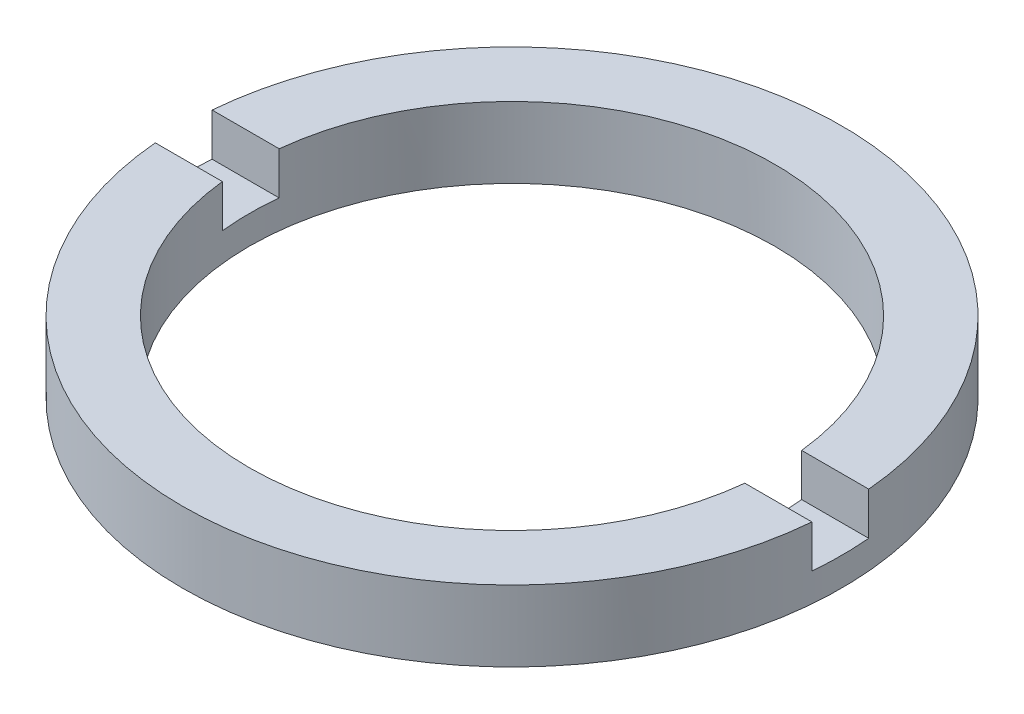
ISO-10303-21;
HEADER;
FILE_DESCRIPTION(('STEP AP214'),'2;1');
FILE_NAME('part.step','',(''),(''),'','','');
FILE_SCHEMA(('AUTOMOTIVE_DESIGN { 1 0 10303 214 1 1 1 1 }'));
ENDSEC;
DATA;
#1=APPLICATION_CONTEXT('core data for automotive mechanical design processes');
#2=APPLICATION_PROTOCOL_DEFINITION('international standard','automotive_design',2000,#1);
#3=PRODUCT_CONTEXT('',#1,'mechanical');
#4=PRODUCT('Part','Part','',(#3));
#5=PRODUCT_RELATED_PRODUCT_CATEGORY('part','',(#4));
#6=PRODUCT_DEFINITION_FORMATION('','',#4);
#7=PRODUCT_DEFINITION_CONTEXT('part definition',#1,'design');
#8=PRODUCT_DEFINITION('design','',#6,#7);
#9=PRODUCT_DEFINITION_SHAPE('','',#8);
#10=(LENGTH_UNIT() NAMED_UNIT(*) SI_UNIT(.MILLI.,.METRE.));
#11=(NAMED_UNIT(*) PLANE_ANGLE_UNIT() SI_UNIT($,.RADIAN.));
#12=(NAMED_UNIT(*) SI_UNIT($,.STERADIAN.) SOLID_ANGLE_UNIT());
#13=UNCERTAINTY_MEASURE_WITH_UNIT(LENGTH_MEASURE(1.E-05),#10,'distance_accuracy_value','');
#14=(GEOMETRIC_REPRESENTATION_CONTEXT(3) GLOBAL_UNCERTAINTY_ASSIGNED_CONTEXT((#13)) GLOBAL_UNIT_ASSIGNED_CONTEXT((#10,
#11,#12)) REPRESENTATION_CONTEXT('',''));
#15=CARTESIAN_POINT('',(0.,0.,0.));
#16=DIRECTION('',(0.,0.,1.));
#17=DIRECTION('',(1.,0.,0.));
#18=AXIS2_PLACEMENT_3D('',#15,#16,#17);
#19=CARTESIAN_POINT('',(9.25000000000001,-1.96424978717943,0.));
#20=DIRECTION('',(0.,-1.,0.));
#21=DIRECTION('',(0.,0.,-1.));
#22=AXIS2_PLACEMENT_3D('',#19,#20,#21);
#23=PLANE('',#22);
#24=CARTESIAN_POINT('',(0.,-1.96424978717943,0.));
#25=DIRECTION('',(0.,1.,0.));
#26=DIRECTION('',(0.,0.,1.));
#27=AXIS2_PLACEMENT_3D('',#24,#25,#26);
#28=CIRCLE('',#27,11.6);
#29=CARTESIAN_POINT('',(-11.5568161705549,-1.96424978717943,1.));
#30=VERTEX_POINT('',#29);
#31=CARTESIAN_POINT('',(11.5568161705549,-1.96424978717943,1.));
#32=VERTEX_POINT('',#31);
#33=EDGE_CURVE('E134',#30,#32,#28,.T.);
#34=ORIENTED_EDGE('',*,*,#33,.T.);
#35=DIRECTION('',(1.,0.,0.));
#36=VECTOR('',#35,1.);
#37=CARTESIAN_POINT('',(-26.8525402726146,-1.96424978717943,1.));
#38=LINE('',#37,#36);
#39=CARTESIAN_POINT('',(9.19578707887477,-1.96424978717943,1.));
#40=VERTEX_POINT('',#39);
#41=EDGE_CURVE('E126',#40,#32,#38,.T.);
#42=ORIENTED_EDGE('',*,*,#41,.F.);
#43=CARTESIAN_POINT('',(0.,-1.96424978717943,0.));
#44=DIRECTION('',(0.,1.,0.));
#45=DIRECTION('',(0.,0.,1.));
#46=AXIS2_PLACEMENT_3D('',#43,#44,#45);
#47=CIRCLE('',#46,9.25000000000001);
#48=CARTESIAN_POINT('',(-9.19578707887477,-1.96424978717943,1.));
#49=VERTEX_POINT('',#48);
#50=EDGE_CURVE('E144',#49,#40,#47,.T.);
#51=ORIENTED_EDGE('',*,*,#50,.F.);
#52=EDGE_CURVE('E166',#30,#49,#38,.T.);
#53=ORIENTED_EDGE('',*,*,#52,.F.);
#54=EDGE_LOOP('',(#34,#42,#51,#53));
#55=FACE_BOUND('',#54,.T.);
#56=ADVANCED_FACE('F40',(#55),#23,.F.);
#57=CARTESIAN_POINT('',(0.,56.2608426270136,0.));
#58=DIRECTION('',(0.,1.,0.));
#59=DIRECTION('',(0.,0.,1.));
#60=AXIS2_PLACEMENT_3D('',#57,#58,#59);
#61=CYLINDRICAL_SURFACE('',#60,11.6);
#62=CARTESIAN_POINT('',(0.,-3.46424978717943,0.));
#63=DIRECTION('',(0.,1.,0.));
#64=DIRECTION('',(0.,0.,1.));
#65=AXIS2_PLACEMENT_3D('',#62,#63,#64);
#66=CIRCLE('',#65,11.6);
#67=CARTESIAN_POINT('',(11.5568161705549,-3.46424978717943,1.));
#68=VERTEX_POINT('',#67);
#69=CARTESIAN_POINT('',(11.5568161705549,-3.46424978717943,-1.));
#70=VERTEX_POINT('',#69);
#71=EDGE_CURVE('E115',#68,#70,#66,.T.);
#72=ORIENTED_EDGE('',*,*,#71,.F.);
#73=DIRECTION('',(0.,1.,0.));
#74=VECTOR('',#73,1.);
#75=CARTESIAN_POINT('',(11.5568161705549,56.2608426270136,1.));
#76=LINE('',#75,#74);
#77=EDGE_CURVE('E186',#68,#32,#76,.T.);
#78=ORIENTED_EDGE('',*,*,#77,.T.);
#79=ORIENTED_EDGE('',*,*,#33,.F.);
#80=DIRECTION('',(0.,1.,0.));
#81=VECTOR('',#80,1.);
#82=CARTESIAN_POINT('',(-11.5568161705549,56.2608426270136,1.));
#83=LINE('',#82,#81);
#84=CARTESIAN_POINT('',(-11.5568161705549,-3.46424978717943,1.));
#85=VERTEX_POINT('',#84);
#86=EDGE_CURVE('E182',#30,#85,#83,.F.);
#87=ORIENTED_EDGE('',*,*,#86,.T.);
#88=CARTESIAN_POINT('',(-11.5568161705549,-3.46424978717943,-1.));
#89=VERTEX_POINT('',#88);
#90=EDGE_CURVE('E177',#89,#85,#66,.T.);
#91=ORIENTED_EDGE('',*,*,#90,.F.);
#92=DIRECTION('',(0.,1.,0.));
#93=VECTOR('',#92,1.);
#94=CARTESIAN_POINT('',(-11.5568161705549,56.2608426270136,-1.));
#95=LINE('',#94,#93);
#96=CARTESIAN_POINT('',(-11.5568161705549,-1.96424978717943,-1.));
#97=VERTEX_POINT('',#96);
#98=EDGE_CURVE('E114',#89,#97,#95,.T.);
#99=ORIENTED_EDGE('',*,*,#98,.T.);
#100=CARTESIAN_POINT('',(11.5568161705549,-1.96424978717943,-1.));
#101=VERTEX_POINT('',#100);
#102=EDGE_CURVE('E122',#101,#97,#28,.T.);
#103=ORIENTED_EDGE('',*,*,#102,.F.);
#104=DIRECTION('',(0.,1.,0.));
#105=VECTOR('',#104,1.);
#106=CARTESIAN_POINT('',(11.5568161705549,56.2608426270136,-1.));
#107=LINE('',#106,#105);
#108=EDGE_CURVE('E105',#101,#70,#107,.F.);
#109=ORIENTED_EDGE('',*,*,#108,.T.);
#110=EDGE_LOOP('',(#72,#78,#79,#87,#91,#99,#103,#109));
#111=FACE_BOUND('',#110,.T.);
#112=CARTESIAN_POINT('',(0.,-4.46424978717943,0.));
#113=DIRECTION('',(0.,1.,0.));
#114=DIRECTION('',(0.,0.,1.));
#115=AXIS2_PLACEMENT_3D('',#112,#113,#114);
#116=CIRCLE('',#115,11.6);
#117=CARTESIAN_POINT('',(0.,-4.46424978717943,11.6));
#118=VERTEX_POINT('',#117);
#119=EDGE_CURVE('E190',#118,#118,#116,.T.);
#120=ORIENTED_EDGE('',*,*,#119,.T.);
#121=EDGE_LOOP('',(#120));
#122=FACE_BOUND('',#121,.T.);
#123=ADVANCED_FACE('F42',(#111,#122),#61,.T.);
#124=ORIENTED_EDGE('',*,*,#102,.T.);
#125=DIRECTION('',(-1.,0.,0.));
#126=VECTOR('',#125,1.);
#127=CARTESIAN_POINT('',(-26.8525402726146,-1.96424978717943,-1.));
#128=LINE('',#127,#126);
#129=CARTESIAN_POINT('',(-9.19578707887477,-1.96424978717943,-1.));
#130=VERTEX_POINT('',#129);
#131=EDGE_CURVE('E127',#130,#97,#128,.T.);
#132=ORIENTED_EDGE('',*,*,#131,.F.);
#133=CARTESIAN_POINT('',(9.19578707887477,-1.96424978717943,-1.));
#134=VERTEX_POINT('',#133);
#135=EDGE_CURVE('E124',#134,#130,#47,.T.);
#136=ORIENTED_EDGE('',*,*,#135,.F.);
#137=EDGE_CURVE('E108',#101,#134,#128,.T.);
#138=ORIENTED_EDGE('',*,*,#137,.F.);
#139=EDGE_LOOP('',(#124,#132,#136,#138));
#140=FACE_BOUND('',#139,.T.);
#141=ADVANCED_FACE('F120',(#140),#23,.F.);
#142=CARTESIAN_POINT('',(0.,56.2608426270136,0.));
#143=DIRECTION('',(0.,1.,0.));
#144=DIRECTION('',(0.,0.,1.));
#145=AXIS2_PLACEMENT_3D('',#142,#143,#144);
#146=CYLINDRICAL_SURFACE('',#145,9.25000000000001);
#147=CARTESIAN_POINT('',(0.,-3.46424978717943,0.));
#148=DIRECTION('',(0.,1.,0.));
#149=DIRECTION('',(0.,0.,1.));
#150=AXIS2_PLACEMENT_3D('',#147,#148,#149);
#151=CIRCLE('',#150,9.25000000000001);
#152=CARTESIAN_POINT('',(-9.19578707887477,-3.46424978717943,1.));
#153=VERTEX_POINT('',#152);
#154=CARTESIAN_POINT('',(-9.19578707887477,-3.46424978717943,-1.));
#155=VERTEX_POINT('',#154);
#156=EDGE_CURVE('E140',#153,#155,#151,.F.);
#157=ORIENTED_EDGE('',*,*,#156,.F.);
#158=DIRECTION('',(0.,1.,0.));
#159=VECTOR('',#158,1.);
#160=CARTESIAN_POINT('',(-9.19578707887477,56.2608426270136,1.));
#161=LINE('',#160,#159);
#162=EDGE_CURVE('E11',#153,#49,#161,.T.);
#163=ORIENTED_EDGE('',*,*,#162,.T.);
#164=ORIENTED_EDGE('',*,*,#50,.T.);
#165=DIRECTION('',(0.,1.,0.));
#166=VECTOR('',#165,1.);
#167=CARTESIAN_POINT('',(9.19578707887477,56.2608426270136,1.));
#168=LINE('',#167,#166);
#169=CARTESIAN_POINT('',(9.19578707887477,-3.46424978717943,1.));
#170=VERTEX_POINT('',#169);
#171=EDGE_CURVE('E149',#40,#170,#168,.F.);
#172=ORIENTED_EDGE('',*,*,#171,.T.);
#173=CARTESIAN_POINT('',(9.19578707887477,-3.46424978717943,-1.));
#174=VERTEX_POINT('',#173);
#175=EDGE_CURVE('E133',#174,#170,#151,.F.);
#176=ORIENTED_EDGE('',*,*,#175,.F.);
#177=DIRECTION('',(0.,1.,0.));
#178=VECTOR('',#177,1.);
#179=CARTESIAN_POINT('',(9.19578707887477,56.2608426270136,-1.));
#180=LINE('',#179,#178);
#181=EDGE_CURVE('E138',#174,#134,#180,.T.);
#182=ORIENTED_EDGE('',*,*,#181,.T.);
#183=ORIENTED_EDGE('',*,*,#135,.T.);
#184=DIRECTION('',(0.,1.,0.));
#185=VECTOR('',#184,1.);
#186=CARTESIAN_POINT('',(-9.19578707887477,56.2608426270136,-1.));
#187=LINE('',#186,#185);
#188=EDGE_CURVE('E49',#130,#155,#187,.F.);
#189=ORIENTED_EDGE('',*,*,#188,.T.);
#190=EDGE_LOOP('',(#157,#163,#164,#172,#176,#182,#183,#189));
#191=FACE_BOUND('',#190,.T.);
#192=CARTESIAN_POINT('',(0.,-4.46424978717943,0.));
#193=DIRECTION('',(0.,1.,0.));
#194=DIRECTION('',(0.,0.,1.));
#195=AXIS2_PLACEMENT_3D('',#192,#193,#194);
#196=CIRCLE('',#195,9.25000000000001);
#197=CARTESIAN_POINT('',(0.,-4.46424978717943,9.25000000000001));
#198=VERTEX_POINT('',#197);
#199=EDGE_CURVE('E193',#198,#198,#196,.T.);
#200=ORIENTED_EDGE('',*,*,#199,.F.);
#201=EDGE_LOOP('',(#200));
#202=FACE_BOUND('',#201,.T.);
#203=ADVANCED_FACE('F201',(#191,#202),#146,.F.);
#204=CARTESIAN_POINT('',(9.25000000000001,-4.46424978717943,0.));
#205=DIRECTION('',(0.,1.,0.));
#206=DIRECTION('',(0.,0.,1.));
#207=AXIS2_PLACEMENT_3D('',#204,#205,#206);
#208=PLANE('',#207);
#209=ORIENTED_EDGE('',*,*,#119,.F.);
#210=EDGE_LOOP('',(#209));
#211=FACE_BOUND('',#210,.T.);
#212=ORIENTED_EDGE('',*,*,#199,.T.);
#213=EDGE_LOOP('',(#212));
#214=FACE_BOUND('',#213,.T.);
#215=ADVANCED_FACE('F231',(#211,#214),#208,.F.);
#216=CARTESIAN_POINT('',(0.,-3.46424978717943,0.));
#217=DIRECTION('',(0.,1.,0.));
#218=DIRECTION('',(0.,0.,1.));
#219=AXIS2_PLACEMENT_3D('',#216,#217,#218);
#220=PLANE('',#219);
#221=ORIENTED_EDGE('',*,*,#71,.T.);
#222=DIRECTION('',(-1.,0.,0.));
#223=VECTOR('',#222,1.);
#224=CARTESIAN_POINT('',(-26.8525402726146,-3.46424978717943,-1.));
#225=LINE('',#224,#223);
#226=EDGE_CURVE('E64',#70,#174,#225,.T.);
#227=ORIENTED_EDGE('',*,*,#226,.T.);
#228=ORIENTED_EDGE('',*,*,#175,.T.);
#229=DIRECTION('',(1.,0.,0.));
#230=VECTOR('',#229,1.);
#231=CARTESIAN_POINT('',(-26.8525402726146,-3.46424978717943,1.));
#232=LINE('',#231,#230);
#233=EDGE_CURVE('E169',#170,#68,#232,.T.);
#234=ORIENTED_EDGE('',*,*,#233,.T.);
#235=EDGE_LOOP('',(#221,#227,#228,#234));
#236=FACE_BOUND('',#235,.T.);
#237=ADVANCED_FACE('F205',(#236),#220,.T.);
#238=CARTESIAN_POINT('',(-26.8525402726146,-3.46424978717943,-1.));
#239=DIRECTION('',(0.,0.,-1.));
#240=DIRECTION('',(-1.,0.,0.));
#241=AXIS2_PLACEMENT_3D('',#238,#239,#240);
#242=PLANE('',#241);
#243=ORIENTED_EDGE('',*,*,#137,.T.);
#244=ORIENTED_EDGE('',*,*,#181,.F.);
#245=ORIENTED_EDGE('',*,*,#226,.F.);
#246=ORIENTED_EDGE('',*,*,#108,.F.);
#247=EDGE_LOOP('',(#243,#244,#245,#246));
#248=FACE_BOUND('',#247,.T.);
#249=ADVANCED_FACE('F107',(#248),#242,.F.);
#250=CARTESIAN_POINT('',(-26.8525402726146,-3.46424978717943,1.));
#251=DIRECTION('',(0.,0.,1.));
#252=DIRECTION('',(1.,0.,0.));
#253=AXIS2_PLACEMENT_3D('',#250,#251,#252);
#254=PLANE('',#253);
#255=ORIENTED_EDGE('',*,*,#233,.F.);
#256=ORIENTED_EDGE('',*,*,#171,.F.);
#257=ORIENTED_EDGE('',*,*,#41,.T.);
#258=ORIENTED_EDGE('',*,*,#77,.F.);
#259=EDGE_LOOP('',(#255,#256,#257,#258));
#260=FACE_BOUND('',#259,.T.);
#261=ADVANCED_FACE('F207',(#260),#254,.F.);
#262=ORIENTED_EDGE('',*,*,#52,.T.);
#263=ORIENTED_EDGE('',*,*,#162,.F.);
#264=EDGE_CURVE('E56',#85,#153,#232,.T.);
#265=ORIENTED_EDGE('',*,*,#264,.F.);
#266=ORIENTED_EDGE('',*,*,#86,.F.);
#267=EDGE_LOOP('',(#262,#263,#265,#266));
#268=FACE_BOUND('',#267,.T.);
#269=ADVANCED_FACE('F213',(#268),#254,.F.);
#270=EDGE_CURVE('E162',#155,#89,#225,.T.);
#271=ORIENTED_EDGE('',*,*,#270,.F.);
#272=ORIENTED_EDGE('',*,*,#188,.F.);
#273=ORIENTED_EDGE('',*,*,#131,.T.);
#274=ORIENTED_EDGE('',*,*,#98,.F.);
#275=EDGE_LOOP('',(#271,#272,#273,#274));
#276=FACE_BOUND('',#275,.T.);
#277=ADVANCED_FACE('F164',(#276),#242,.F.);
#278=ORIENTED_EDGE('',*,*,#90,.T.);
#279=ORIENTED_EDGE('',*,*,#264,.T.);
#280=ORIENTED_EDGE('',*,*,#156,.T.);
#281=ORIENTED_EDGE('',*,*,#270,.T.);
#282=EDGE_LOOP('',(#278,#279,#280,#281));
#283=FACE_BOUND('',#282,.T.);
#284=ADVANCED_FACE('F161',(#283),#220,.T.);
#285=CLOSED_SHELL('',(#56,#123,#141,#203,#215,#237,#249,#261,#269,#277,#284));
#286=MANIFOLD_SOLID_BREP('B2',#285);
#287=ADVANCED_BREP_SHAPE_REPRESENTATION('',(#18,#286),#14);
#288=SHAPE_DEFINITION_REPRESENTATION(#9,#287);
ENDSEC;
END-ISO-10303-21;
